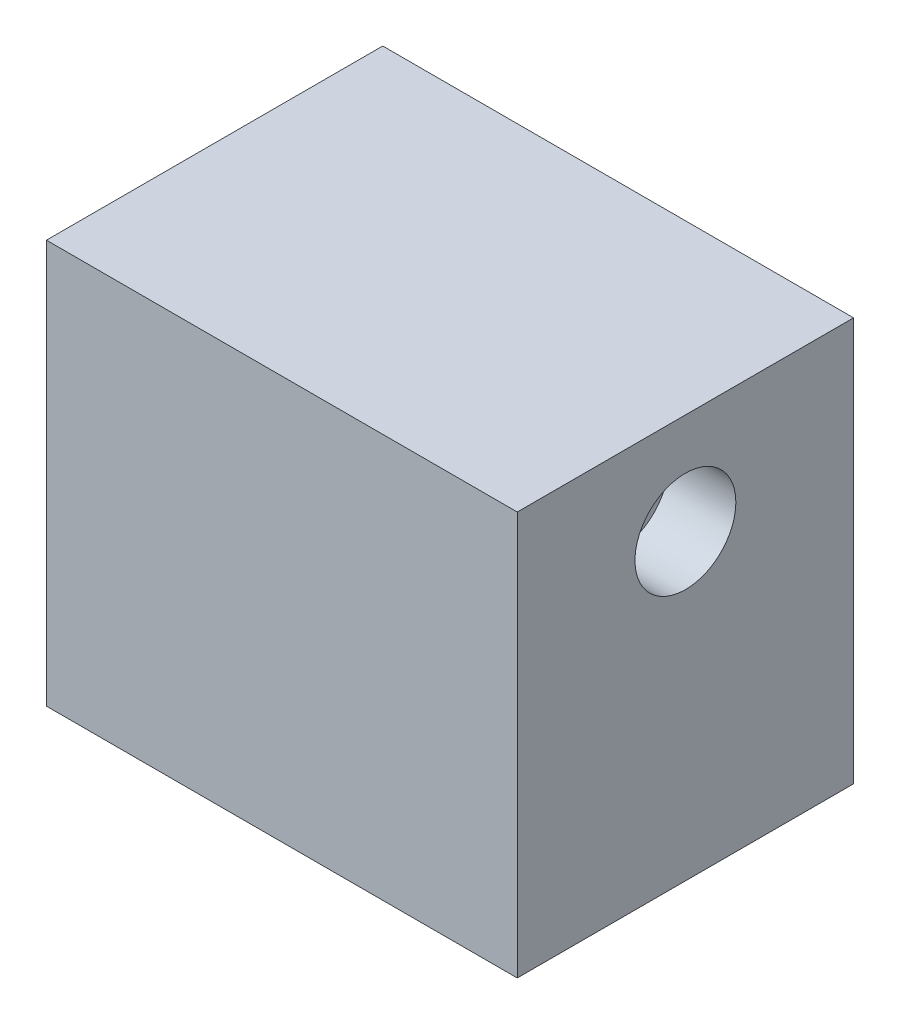
ISO-10303-21;
HEADER;
FILE_DESCRIPTION(('STEP AP214'),'2;1');
FILE_NAME('part.step','',(''),(''),'','','');
FILE_SCHEMA(('AUTOMOTIVE_DESIGN { 1 0 10303 214 1 1 1 1 }'));
ENDSEC;
DATA;
#1=APPLICATION_CONTEXT('core data for automotive mechanical design processes');
#2=APPLICATION_PROTOCOL_DEFINITION('international standard','automotive_design',2000,#1);
#3=PRODUCT_CONTEXT('',#1,'mechanical');
#4=PRODUCT('Part','Part','',(#3));
#5=PRODUCT_RELATED_PRODUCT_CATEGORY('part','',(#4));
#6=PRODUCT_DEFINITION_FORMATION('','',#4);
#7=PRODUCT_DEFINITION_CONTEXT('part definition',#1,'design');
#8=PRODUCT_DEFINITION('design','',#6,#7);
#9=PRODUCT_DEFINITION_SHAPE('','',#8);
#10=(LENGTH_UNIT() NAMED_UNIT(*) SI_UNIT(.MILLI.,.METRE.));
#11=(NAMED_UNIT(*) PLANE_ANGLE_UNIT() SI_UNIT($,.RADIAN.));
#12=(NAMED_UNIT(*) SI_UNIT($,.STERADIAN.) SOLID_ANGLE_UNIT());
#13=UNCERTAINTY_MEASURE_WITH_UNIT(LENGTH_MEASURE(1.E-05),#10,'distance_accuracy_value','');
#14=(GEOMETRIC_REPRESENTATION_CONTEXT(3) GLOBAL_UNCERTAINTY_ASSIGNED_CONTEXT((#13)) GLOBAL_UNIT_ASSIGNED_CONTEXT((#10,
#11,#12)) REPRESENTATION_CONTEXT('',''));
#15=CARTESIAN_POINT('',(0.,0.,0.));
#16=DIRECTION('',(0.,0.,1.));
#17=DIRECTION('',(1.,0.,0.));
#18=AXIS2_PLACEMENT_3D('',#15,#16,#17);
#19=CARTESIAN_POINT('',(0.,30.,0.));
#20=DIRECTION('',(1.,0.,0.));
#21=DIRECTION('',(0.,0.,-1.));
#22=AXIS2_PLACEMENT_3D('',#19,#20,#21);
#23=PLANE('',#22);
#24=CARTESIAN_POINT('',(0.,22.5,-12.5));
#25=DIRECTION('',(-1.,0.,0.));
#26=DIRECTION('',(0.,0.,1.));
#27=AXIS2_PLACEMENT_3D('',#24,#25,#26);
#28=CIRCLE('',#27,3.75);
#29=CARTESIAN_POINT('',(0.,22.5,-8.75));
#30=VERTEX_POINT('',#29);
#31=EDGE_CURVE('E118',#30,#30,#28,.T.);
#32=ORIENTED_EDGE('',*,*,#31,.F.);
#33=EDGE_LOOP('',(#32));
#34=FACE_BOUND('',#33,.T.);
#35=DIRECTION('',(0.,0.,1.));
#36=VECTOR('',#35,1.);
#37=CARTESIAN_POINT('',(0.,0.,0.));
#38=LINE('',#37,#36);
#39=CARTESIAN_POINT('',(0.,0.,-25.));
#40=VERTEX_POINT('',#39);
#41=CARTESIAN_POINT('',(0.,0.,0.));
#42=VERTEX_POINT('',#41);
#43=EDGE_CURVE('E98',#40,#42,#38,.T.);
#44=ORIENTED_EDGE('',*,*,#43,.T.);
#45=DIRECTION('',(0.,-1.,0.));
#46=VECTOR('',#45,1.);
#47=CARTESIAN_POINT('',(0.,30.,0.));
#48=LINE('',#47,#46);
#49=CARTESIAN_POINT('',(0.,30.,0.));
#50=VERTEX_POINT('',#49);
#51=EDGE_CURVE('E11',#50,#42,#48,.T.);
#52=ORIENTED_EDGE('',*,*,#51,.F.);
#53=DIRECTION('',(0.,0.,1.));
#54=VECTOR('',#53,1.);
#55=CARTESIAN_POINT('',(0.,30.,0.));
#56=LINE('',#55,#54);
#57=CARTESIAN_POINT('',(0.,30.,-25.));
#58=VERTEX_POINT('',#57);
#59=EDGE_CURVE('E86',#58,#50,#56,.T.);
#60=ORIENTED_EDGE('',*,*,#59,.F.);
#61=DIRECTION('',(0.,-1.,0.));
#62=VECTOR('',#61,1.);
#63=CARTESIAN_POINT('',(0.,30.,-25.));
#64=LINE('',#63,#62);
#65=EDGE_CURVE('E94',#58,#40,#64,.T.);
#66=ORIENTED_EDGE('',*,*,#65,.T.);
#67=EDGE_LOOP('',(#44,#52,#60,#66));
#68=FACE_BOUND('',#67,.T.);
#69=ADVANCED_FACE('F35',(#34,#68),#23,.F.);
#70=CARTESIAN_POINT('',(0.,30.,0.));
#71=DIRECTION('',(0.,0.,-1.));
#72=DIRECTION('',(-1.,0.,0.));
#73=AXIS2_PLACEMENT_3D('',#70,#71,#72);
#74=PLANE('',#73);
#75=DIRECTION('',(1.,0.,0.));
#76=VECTOR('',#75,1.);
#77=CARTESIAN_POINT('',(0.,0.,0.));
#78=LINE('',#77,#76);
#79=CARTESIAN_POINT('',(35.,0.,0.));
#80=VERTEX_POINT('',#79);
#81=EDGE_CURVE('E90',#42,#80,#78,.T.);
#82=ORIENTED_EDGE('',*,*,#81,.T.);
#83=DIRECTION('',(0.,-1.,0.));
#84=VECTOR('',#83,1.);
#85=CARTESIAN_POINT('',(35.,30.,0.));
#86=LINE('',#85,#84);
#87=CARTESIAN_POINT('',(35.,30.,0.));
#88=VERTEX_POINT('',#87);
#89=EDGE_CURVE('E43',#88,#80,#86,.T.);
#90=ORIENTED_EDGE('',*,*,#89,.F.);
#91=DIRECTION('',(1.,0.,0.));
#92=VECTOR('',#91,1.);
#93=CARTESIAN_POINT('',(0.,30.,0.));
#94=LINE('',#93,#92);
#95=EDGE_CURVE('E81',#50,#88,#94,.T.);
#96=ORIENTED_EDGE('',*,*,#95,.F.);
#97=ORIENTED_EDGE('',*,*,#51,.T.);
#98=EDGE_LOOP('',(#82,#90,#96,#97));
#99=FACE_BOUND('',#98,.T.);
#100=ADVANCED_FACE('F89',(#99),#74,.F.);
#101=CARTESIAN_POINT('',(35.,30.,0.));
#102=DIRECTION('',(-1.,0.,0.));
#103=DIRECTION('',(0.,0.,1.));
#104=AXIS2_PLACEMENT_3D('',#101,#102,#103);
#105=PLANE('',#104);
#106=CARTESIAN_POINT('',(35.,22.5,-12.5));
#107=DIRECTION('',(1.,0.,0.));
#108=DIRECTION('',(0.,0.,-1.));
#109=AXIS2_PLACEMENT_3D('',#106,#107,#108);
#110=CIRCLE('',#109,3.75);
#111=CARTESIAN_POINT('',(35.,22.5,-16.25));
#112=VERTEX_POINT('',#111);
#113=EDGE_CURVE('E112',#112,#112,#110,.T.);
#114=ORIENTED_EDGE('',*,*,#113,.F.);
#115=EDGE_LOOP('',(#114));
#116=FACE_BOUND('',#115,.T.);
#117=DIRECTION('',(0.,0.,-1.));
#118=VECTOR('',#117,1.);
#119=CARTESIAN_POINT('',(35.,0.,0.));
#120=LINE('',#119,#118);
#121=CARTESIAN_POINT('',(35.,0.,-25.));
#122=VERTEX_POINT('',#121);
#123=EDGE_CURVE('E68',#80,#122,#120,.T.);
#124=ORIENTED_EDGE('',*,*,#123,.T.);
#125=DIRECTION('',(0.,-1.,0.));
#126=VECTOR('',#125,1.);
#127=CARTESIAN_POINT('',(35.,30.,-25.));
#128=LINE('',#127,#126);
#129=CARTESIAN_POINT('',(35.,30.,-25.));
#130=VERTEX_POINT('',#129);
#131=EDGE_CURVE('E91',#130,#122,#128,.T.);
#132=ORIENTED_EDGE('',*,*,#131,.F.);
#133=DIRECTION('',(0.,0.,-1.));
#134=VECTOR('',#133,1.);
#135=CARTESIAN_POINT('',(35.,30.,0.));
#136=LINE('',#135,#134);
#137=EDGE_CURVE('E84',#88,#130,#136,.T.);
#138=ORIENTED_EDGE('',*,*,#137,.F.);
#139=ORIENTED_EDGE('',*,*,#89,.T.);
#140=EDGE_LOOP('',(#124,#132,#138,#139));
#141=FACE_BOUND('',#140,.T.);
#142=ADVANCED_FACE('F92',(#116,#141),#105,.F.);
#143=CARTESIAN_POINT('',(0.,30.,-25.));
#144=DIRECTION('',(0.,0.,1.));
#145=DIRECTION('',(1.,0.,0.));
#146=AXIS2_PLACEMENT_3D('',#143,#144,#145);
#147=PLANE('',#146);
#148=DIRECTION('',(-1.,0.,0.));
#149=VECTOR('',#148,1.);
#150=CARTESIAN_POINT('',(0.,0.,-25.));
#151=LINE('',#150,#149);
#152=EDGE_CURVE('E74',#122,#40,#151,.T.);
#153=ORIENTED_EDGE('',*,*,#152,.T.);
#154=ORIENTED_EDGE('',*,*,#65,.F.);
#155=DIRECTION('',(-1.,0.,0.));
#156=VECTOR('',#155,1.);
#157=CARTESIAN_POINT('',(0.,30.,-25.));
#158=LINE('',#157,#156);
#159=EDGE_CURVE('E51',#130,#58,#158,.T.);
#160=ORIENTED_EDGE('',*,*,#159,.F.);
#161=ORIENTED_EDGE('',*,*,#131,.T.);
#162=EDGE_LOOP('',(#153,#154,#160,#161));
#163=FACE_BOUND('',#162,.T.);
#164=ADVANCED_FACE('F106',(#163),#147,.F.);
#165=CARTESIAN_POINT('',(0.,30.,0.));
#166=DIRECTION('',(0.,-1.,0.));
#167=DIRECTION('',(0.,0.,-1.));
#168=AXIS2_PLACEMENT_3D('',#165,#166,#167);
#169=PLANE('',#168);
#170=ORIENTED_EDGE('',*,*,#59,.T.);
#171=ORIENTED_EDGE('',*,*,#95,.T.);
#172=ORIENTED_EDGE('',*,*,#137,.T.);
#173=ORIENTED_EDGE('',*,*,#159,.T.);
#174=EDGE_LOOP('',(#170,#171,#172,#173));
#175=FACE_BOUND('',#174,.T.);
#176=ADVANCED_FACE('F82',(#175),#169,.F.);
#177=CARTESIAN_POINT('',(0.,0.,0.));
#178=DIRECTION('',(0.,-1.,0.));
#179=DIRECTION('',(0.,0.,-1.));
#180=AXIS2_PLACEMENT_3D('',#177,#178,#179);
#181=PLANE('',#180);
#182=ORIENTED_EDGE('',*,*,#43,.F.);
#183=ORIENTED_EDGE('',*,*,#152,.F.);
#184=ORIENTED_EDGE('',*,*,#123,.F.);
#185=ORIENTED_EDGE('',*,*,#81,.F.);
#186=EDGE_LOOP('',(#182,#183,#184,#185));
#187=FACE_BOUND('',#186,.T.);
#188=ADVANCED_FACE('F109',(#187),#181,.T.);
#189=CARTESIAN_POINT('',(30.,22.5,-12.5));
#190=DIRECTION('',(1.,0.,0.));
#191=DIRECTION('',(0.,0.,-1.));
#192=AXIS2_PLACEMENT_3D('',#189,#190,#191);
#193=CYLINDRICAL_SURFACE('',#192,3.75);
#194=CARTESIAN_POINT('',(30.,22.5,-12.5));
#195=DIRECTION('',(1.,0.,0.));
#196=DIRECTION('',(0.,0.,-1.));
#197=AXIS2_PLACEMENT_3D('',#194,#195,#196);
#198=CIRCLE('',#197,3.75);
#199=CARTESIAN_POINT('',(30.,22.5,-16.25));
#200=VERTEX_POINT('',#199);
#201=EDGE_CURVE('E101',#200,#200,#198,.T.);
#202=ORIENTED_EDGE('',*,*,#201,.F.);
#203=EDGE_LOOP('',(#202));
#204=FACE_BOUND('',#203,.T.);
#205=ORIENTED_EDGE('',*,*,#113,.T.);
#206=EDGE_LOOP('',(#205));
#207=FACE_BOUND('',#206,.T.);
#208=ADVANCED_FACE('F147',(#204,#207),#193,.F.);
#209=CARTESIAN_POINT('',(30.,22.5,-12.5));
#210=DIRECTION('',(1.,0.,0.));
#211=DIRECTION('',(0.,0.,-1.));
#212=AXIS2_PLACEMENT_3D('',#209,#210,#211);
#213=PLANE('',#212);
#214=ORIENTED_EDGE('',*,*,#201,.T.);
#215=EDGE_LOOP('',(#214));
#216=FACE_BOUND('',#215,.T.);
#217=ADVANCED_FACE('F129',(#216),#213,.T.);
#218=CARTESIAN_POINT('',(5.,22.5,-12.5));
#219=DIRECTION('',(-1.,0.,0.));
#220=DIRECTION('',(0.,0.,1.));
#221=AXIS2_PLACEMENT_3D('',#218,#219,#220);
#222=CYLINDRICAL_SURFACE('',#221,3.75);
#223=CARTESIAN_POINT('',(5.,22.5,-12.5));
#224=DIRECTION('',(-1.,0.,0.));
#225=DIRECTION('',(0.,0.,1.));
#226=AXIS2_PLACEMENT_3D('',#223,#224,#225);
#227=CIRCLE('',#226,3.75);
#228=CARTESIAN_POINT('',(5.,22.5,-8.75));
#229=VERTEX_POINT('',#228);
#230=EDGE_CURVE('E115',#229,#229,#227,.T.);
#231=ORIENTED_EDGE('',*,*,#230,.F.);
#232=EDGE_LOOP('',(#231));
#233=FACE_BOUND('',#232,.T.);
#234=ORIENTED_EDGE('',*,*,#31,.T.);
#235=EDGE_LOOP('',(#234));
#236=FACE_BOUND('',#235,.T.);
#237=ADVANCED_FACE('F126',(#233,#236),#222,.F.);
#238=CARTESIAN_POINT('',(5.,22.5,-12.5));
#239=DIRECTION('',(-1.,0.,0.));
#240=DIRECTION('',(0.,0.,1.));
#241=AXIS2_PLACEMENT_3D('',#238,#239,#240);
#242=PLANE('',#241);
#243=ORIENTED_EDGE('',*,*,#230,.T.);
#244=EDGE_LOOP('',(#243));
#245=FACE_BOUND('',#244,.T.);
#246=ADVANCED_FACE('F124',(#245),#242,.T.);
#247=CLOSED_SHELL('',(#69,#100,#142,#164,#176,#188,#208,#217,#237,#246));
#248=MANIFOLD_SOLID_BREP('B2',#247);
#249=ADVANCED_BREP_SHAPE_REPRESENTATION('',(#18,#248),#14);
#250=SHAPE_DEFINITION_REPRESENTATION(#9,#249);
ENDSEC;
END-ISO-10303-21;
